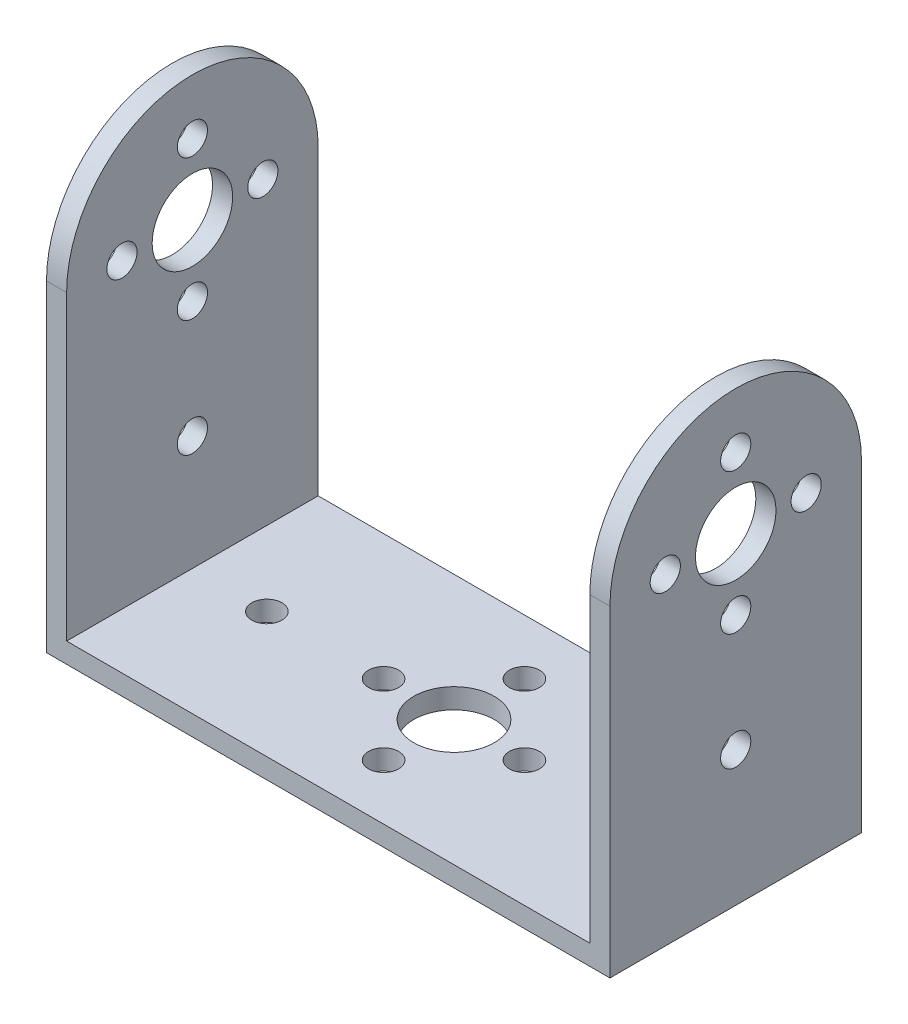
ISO-10303-21;
HEADER;
FILE_DESCRIPTION(('STEP AP214'),'2;1');
FILE_NAME('part.step','',(''),(''),'','','');
FILE_SCHEMA(('AUTOMOTIVE_DESIGN { 1 0 10303 214 1 1 1 1 }'));
ENDSEC;
DATA;
#1=APPLICATION_CONTEXT('core data for automotive mechanical design processes');
#2=APPLICATION_PROTOCOL_DEFINITION('international standard','automotive_design',2000,#1);
#3=PRODUCT_CONTEXT('',#1,'mechanical');
#4=PRODUCT('Part','Part','',(#3));
#5=PRODUCT_RELATED_PRODUCT_CATEGORY('part','',(#4));
#6=PRODUCT_DEFINITION_FORMATION('','',#4);
#7=PRODUCT_DEFINITION_CONTEXT('part definition',#1,'design');
#8=PRODUCT_DEFINITION('design','',#6,#7);
#9=PRODUCT_DEFINITION_SHAPE('','',#8);
#10=(LENGTH_UNIT() NAMED_UNIT(*) SI_UNIT(.MILLI.,.METRE.));
#11=(NAMED_UNIT(*) PLANE_ANGLE_UNIT() SI_UNIT($,.RADIAN.));
#12=(NAMED_UNIT(*) SI_UNIT($,.STERADIAN.) SOLID_ANGLE_UNIT());
#13=UNCERTAINTY_MEASURE_WITH_UNIT(LENGTH_MEASURE(1.E-05),#10,'distance_accuracy_value','');
#14=(GEOMETRIC_REPRESENTATION_CONTEXT(3) GLOBAL_UNCERTAINTY_ASSIGNED_CONTEXT((#13)) GLOBAL_UNIT_ASSIGNED_CONTEXT((#10,
#11,#12)) REPRESENTATION_CONTEXT('',''));
#15=CARTESIAN_POINT('',(0.,0.,0.));
#16=DIRECTION('',(0.,0.,1.));
#17=DIRECTION('',(1.,0.,0.));
#18=AXIS2_PLACEMENT_3D('',#15,#16,#17);
#19=CARTESIAN_POINT('',(25.9999999999998,2.,12.5));
#20=DIRECTION('',(0.,0.,-1.));
#21=DIRECTION('',(-1.,0.,0.));
#22=AXIS2_PLACEMENT_3D('',#19,#20,#21);
#23=PLANE('',#22);
#24=DIRECTION('',(1.,0.,0.));
#25=VECTOR('',#24,1.);
#26=CARTESIAN_POINT('',(25.9999999999998,0.,12.5));
#27=LINE('',#26,#25);
#28=CARTESIAN_POINT('',(-28.0000000000002,0.,12.4999999999999));
#29=VERTEX_POINT('',#28);
#30=CARTESIAN_POINT('',(27.9999999999998,0.,12.5));
#31=VERTEX_POINT('',#30);
#32=EDGE_CURVE('E114',#29,#31,#27,.T.);
#33=ORIENTED_EDGE('',*,*,#32,.T.);
#34=DIRECTION('',(0.,-1.,0.));
#35=VECTOR('',#34,1.);
#36=CARTESIAN_POINT('',(27.9999999999998,0.,12.5));
#37=LINE('',#36,#35);
#38=CARTESIAN_POINT('',(27.9999999999998,32.,12.5));
#39=VERTEX_POINT('',#38);
#40=EDGE_CURVE('E187',#39,#31,#37,.T.);
#41=ORIENTED_EDGE('',*,*,#40,.F.);
#42=DIRECTION('',(-1.,0.,0.));
#43=VECTOR('',#42,1.);
#44=CARTESIAN_POINT('',(27.9999999999998,32.,12.5));
#45=LINE('',#44,#43);
#46=CARTESIAN_POINT('',(25.9999999999998,32.,12.5));
#47=VERTEX_POINT('',#46);
#48=EDGE_CURVE('E196',#39,#47,#45,.T.);
#49=ORIENTED_EDGE('',*,*,#48,.T.);
#50=DIRECTION('',(0.,-1.,0.));
#51=VECTOR('',#50,1.);
#52=CARTESIAN_POINT('',(25.9999999999998,0.,12.5));
#53=LINE('',#52,#51);
#54=CARTESIAN_POINT('',(25.9999999999998,2.,12.5));
#55=VERTEX_POINT('',#54);
#56=EDGE_CURVE('E184',#47,#55,#53,.T.);
#57=ORIENTED_EDGE('',*,*,#56,.T.);
#58=DIRECTION('',(1.,0.,0.));
#59=VECTOR('',#58,1.);
#60=CARTESIAN_POINT('',(25.9999999999998,2.,12.5));
#61=LINE('',#60,#59);
#62=CARTESIAN_POINT('',(-26.0000000000002,2.,12.5));
#63=VERTEX_POINT('',#62);
#64=EDGE_CURVE('E254',#63,#55,#61,.T.);
#65=ORIENTED_EDGE('',*,*,#64,.F.);
#66=DIRECTION('',(0.,1.,0.));
#67=VECTOR('',#66,1.);
#68=CARTESIAN_POINT('',(-26.0000000000002,0.,12.4999999999999));
#69=LINE('',#68,#67);
#70=CARTESIAN_POINT('',(-26.0000000000002,32.,12.4999999999999));
#71=VERTEX_POINT('',#70);
#72=EDGE_CURVE('E61',#63,#71,#69,.T.);
#73=ORIENTED_EDGE('',*,*,#72,.T.);
#74=DIRECTION('',(1.,0.,0.));
#75=VECTOR('',#74,1.);
#76=CARTESIAN_POINT('',(-28.0000000000002,32.,12.4999999999999));
#77=LINE('',#76,#75);
#78=CARTESIAN_POINT('',(-28.0000000000002,32.,12.4999999999999));
#79=VERTEX_POINT('',#78);
#80=EDGE_CURVE('E147',#79,#71,#77,.T.);
#81=ORIENTED_EDGE('',*,*,#80,.F.);
#82=DIRECTION('',(0.,1.,0.));
#83=VECTOR('',#82,1.);
#84=CARTESIAN_POINT('',(-28.0000000000002,0.,12.4999999999999));
#85=LINE('',#84,#83);
#86=EDGE_CURVE('E121',#29,#79,#85,.T.);
#87=ORIENTED_EDGE('',*,*,#86,.F.);
#88=EDGE_LOOP('',(#33,#41,#49,#57,#65,#73,#81,#87));
#89=FACE_BOUND('',#88,.T.);
#90=ADVANCED_FACE('F36',(#89),#23,.F.);
#91=CARTESIAN_POINT('',(25.9999999999998,2.,-12.5000000000001));
#92=DIRECTION('',(0.,0.,1.));
#93=DIRECTION('',(1.,0.,0.));
#94=AXIS2_PLACEMENT_3D('',#91,#92,#93);
#95=PLANE('',#94);
#96=DIRECTION('',(-1.,0.,0.));
#97=VECTOR('',#96,1.);
#98=CARTESIAN_POINT('',(25.9999999999998,0.,-12.5000000000001));
#99=LINE('',#98,#97);
#100=CARTESIAN_POINT('',(27.9999999999998,0.,-12.5));
#101=VERTEX_POINT('',#100);
#102=CARTESIAN_POINT('',(-28.0000000000002,0.,-12.5000000000001));
#103=VERTEX_POINT('',#102);
#104=EDGE_CURVE('E103',#101,#103,#99,.T.);
#105=ORIENTED_EDGE('',*,*,#104,.T.);
#106=DIRECTION('',(0.,-1.,0.));
#107=VECTOR('',#106,1.);
#108=CARTESIAN_POINT('',(-28.0000000000002,0.,-12.5000000000001));
#109=LINE('',#108,#107);
#110=CARTESIAN_POINT('',(-28.0000000000002,32.,-12.5000000000001));
#111=VERTEX_POINT('',#110);
#112=EDGE_CURVE('E108',#111,#103,#109,.T.);
#113=ORIENTED_EDGE('',*,*,#112,.F.);
#114=DIRECTION('',(1.,0.,0.));
#115=VECTOR('',#114,1.);
#116=CARTESIAN_POINT('',(-28.0000000000002,32.,-12.5000000000001));
#117=LINE('',#116,#115);
#118=CARTESIAN_POINT('',(-26.0000000000002,32.,-12.5000000000001));
#119=VERTEX_POINT('',#118);
#120=EDGE_CURVE('E137',#111,#119,#117,.T.);
#121=ORIENTED_EDGE('',*,*,#120,.T.);
#122=DIRECTION('',(0.,-1.,0.));
#123=VECTOR('',#122,1.);
#124=CARTESIAN_POINT('',(-26.0000000000002,0.,-12.5000000000001));
#125=LINE('',#124,#123);
#126=CARTESIAN_POINT('',(-26.0000000000002,2.,-12.5000000000001));
#127=VERTEX_POINT('',#126);
#128=EDGE_CURVE('E142',#119,#127,#125,.T.);
#129=ORIENTED_EDGE('',*,*,#128,.T.);
#130=DIRECTION('',(-1.,0.,0.));
#131=VECTOR('',#130,1.);
#132=CARTESIAN_POINT('',(25.9999999999998,2.,-12.5000000000001));
#133=LINE('',#132,#131);
#134=CARTESIAN_POINT('',(25.9999999999998,2.,-12.5000000000001));
#135=VERTEX_POINT('',#134);
#136=EDGE_CURVE('E11',#135,#127,#133,.T.);
#137=ORIENTED_EDGE('',*,*,#136,.F.);
#138=DIRECTION('',(0.,1.,0.));
#139=VECTOR('',#138,1.);
#140=CARTESIAN_POINT('',(25.9999999999998,0.,-12.5));
#141=LINE('',#140,#139);
#142=CARTESIAN_POINT('',(25.9999999999998,32.,-12.5));
#143=VERTEX_POINT('',#142);
#144=EDGE_CURVE('E53',#135,#143,#141,.T.);
#145=ORIENTED_EDGE('',*,*,#144,.T.);
#146=DIRECTION('',(-1.,0.,0.));
#147=VECTOR('',#146,1.);
#148=CARTESIAN_POINT('',(27.9999999999998,32.,-12.5));
#149=LINE('',#148,#147);
#150=CARTESIAN_POINT('',(27.9999999999998,32.,-12.5));
#151=VERTEX_POINT('',#150);
#152=EDGE_CURVE('E205',#151,#143,#149,.T.);
#153=ORIENTED_EDGE('',*,*,#152,.F.);
#154=DIRECTION('',(0.,1.,0.));
#155=VECTOR('',#154,1.);
#156=CARTESIAN_POINT('',(27.9999999999998,0.,-12.5));
#157=LINE('',#156,#155);
#158=EDGE_CURVE('E110',#101,#151,#157,.T.);
#159=ORIENTED_EDGE('',*,*,#158,.F.);
#160=EDGE_LOOP('',(#105,#113,#121,#129,#137,#145,#153,#159));
#161=FACE_BOUND('',#160,.T.);
#162=ADVANCED_FACE('F105',(#161),#95,.F.);
#163=CARTESIAN_POINT('',(0.,2.,0.));
#164=DIRECTION('',(0.,1.,0.));
#165=DIRECTION('',(0.,0.,1.));
#166=AXIS2_PLACEMENT_3D('',#163,#164,#165);
#167=PLANE('',#166);
#168=CARTESIAN_POINT('',(-18.6,2.,0.));
#169=DIRECTION('',(0.,1.,0.));
#170=DIRECTION('',(0.,0.,1.));
#171=AXIS2_PLACEMENT_3D('',#168,#169,#170);
#172=CIRCLE('',#171,1.5);
#173=CARTESIAN_POINT('',(-18.6,2.,1.5));
#174=VERTEX_POINT('',#173);
#175=EDGE_CURVE('E212',#174,#174,#172,.T.);
#176=ORIENTED_EDGE('',*,*,#175,.F.);
#177=EDGE_LOOP('',(#176));
#178=FACE_BOUND('',#177,.T.);
#179=CARTESIAN_POINT('',(18.6,2.,0.));
#180=DIRECTION('',(0.,1.,0.));
#181=DIRECTION('',(0.,0.,1.));
#182=AXIS2_PLACEMENT_3D('',#179,#180,#181);
#183=CIRCLE('',#182,1.5);
#184=CARTESIAN_POINT('',(18.6,2.,1.5));
#185=VERTEX_POINT('',#184);
#186=EDGE_CURVE('E211',#185,#185,#183,.T.);
#187=ORIENTED_EDGE('',*,*,#186,.F.);
#188=EDGE_LOOP('',(#187));
#189=FACE_BOUND('',#188,.T.);
#190=CARTESIAN_POINT('',(0.,2.,7.));
#191=DIRECTION('',(0.,1.,0.));
#192=DIRECTION('',(0.,0.,1.));
#193=AXIS2_PLACEMENT_3D('',#190,#191,#192);
#194=CIRCLE('',#193,1.5);
#195=CARTESIAN_POINT('',(0.,2.,8.5));
#196=VERTEX_POINT('',#195);
#197=EDGE_CURVE('E218',#196,#196,#194,.T.);
#198=ORIENTED_EDGE('',*,*,#197,.F.);
#199=EDGE_LOOP('',(#198));
#200=FACE_BOUND('',#199,.T.);
#201=CARTESIAN_POINT('',(-7.,2.,0.));
#202=DIRECTION('',(0.,1.,0.));
#203=DIRECTION('',(0.,0.,1.));
#204=AXIS2_PLACEMENT_3D('',#201,#202,#203);
#205=CIRCLE('',#204,1.5);
#206=CARTESIAN_POINT('',(-7.,2.,1.5));
#207=VERTEX_POINT('',#206);
#208=EDGE_CURVE('E224',#207,#207,#205,.T.);
#209=ORIENTED_EDGE('',*,*,#208,.F.);
#210=EDGE_LOOP('',(#209));
#211=FACE_BOUND('',#210,.T.);
#212=CARTESIAN_POINT('',(0.,2.,-7.));
#213=DIRECTION('',(0.,1.,0.));
#214=DIRECTION('',(0.,0.,1.));
#215=AXIS2_PLACEMENT_3D('',#212,#213,#214);
#216=CIRCLE('',#215,1.5);
#217=CARTESIAN_POINT('',(0.,2.,-5.5));
#218=VERTEX_POINT('',#217);
#219=EDGE_CURVE('E230',#218,#218,#216,.T.);
#220=ORIENTED_EDGE('',*,*,#219,.F.);
#221=EDGE_LOOP('',(#220));
#222=FACE_BOUND('',#221,.T.);
#223=CARTESIAN_POINT('',(7.,2.,0.));
#224=DIRECTION('',(0.,1.,0.));
#225=DIRECTION('',(0.,0.,1.));
#226=AXIS2_PLACEMENT_3D('',#223,#224,#225);
#227=CIRCLE('',#226,1.5);
#228=CARTESIAN_POINT('',(7.,2.,1.5));
#229=VERTEX_POINT('',#228);
#230=EDGE_CURVE('E236',#229,#229,#227,.T.);
#231=ORIENTED_EDGE('',*,*,#230,.F.);
#232=EDGE_LOOP('',(#231));
#233=FACE_BOUND('',#232,.T.);
#234=CARTESIAN_POINT('',(0.,2.,0.));
#235=DIRECTION('',(0.,1.,0.));
#236=DIRECTION('',(0.,0.,1.));
#237=AXIS2_PLACEMENT_3D('',#234,#235,#236);
#238=CIRCLE('',#237,4.);
#239=CARTESIAN_POINT('',(0.,2.,4.));
#240=VERTEX_POINT('',#239);
#241=EDGE_CURVE('E242',#240,#240,#238,.T.);
#242=ORIENTED_EDGE('',*,*,#241,.F.);
#243=EDGE_LOOP('',(#242));
#244=FACE_BOUND('',#243,.T.);
#245=DIRECTION('',(0.,0.,1.));
#246=VECTOR('',#245,1.);
#247=CARTESIAN_POINT('',(-26.0000000000002,2.,12.5));
#248=LINE('',#247,#246);
#249=EDGE_CURVE('E39',#127,#63,#248,.T.);
#250=ORIENTED_EDGE('',*,*,#249,.T.);
#251=ORIENTED_EDGE('',*,*,#64,.T.);
#252=DIRECTION('',(0.,0.,-1.));
#253=VECTOR('',#252,1.);
#254=CARTESIAN_POINT('',(25.9999999999998,2.,12.5));
#255=LINE('',#254,#253);
#256=EDGE_CURVE('E45',#55,#135,#255,.T.);
#257=ORIENTED_EDGE('',*,*,#256,.T.);
#258=ORIENTED_EDGE('',*,*,#136,.T.);
#259=EDGE_LOOP('',(#250,#251,#257,#258));
#260=FACE_BOUND('',#259,.T.);
#261=ADVANCED_FACE('F262',(#178,#189,#200,#211,#222,#233,#244,#260),#167,.T.);
#262=CARTESIAN_POINT('',(0.,0.,0.));
#263=DIRECTION('',(0.,1.,0.));
#264=DIRECTION('',(0.,0.,1.));
#265=AXIS2_PLACEMENT_3D('',#262,#263,#264);
#266=PLANE('',#265);
#267=CARTESIAN_POINT('',(-18.6,0.,0.));
#268=DIRECTION('',(0.,1.,0.));
#269=DIRECTION('',(0.,0.,1.));
#270=AXIS2_PLACEMENT_3D('',#267,#268,#269);
#271=CIRCLE('',#270,1.5);
#272=CARTESIAN_POINT('',(-18.6,0.,1.5));
#273=VERTEX_POINT('',#272);
#274=EDGE_CURVE('E208',#273,#273,#271,.T.);
#275=ORIENTED_EDGE('',*,*,#274,.T.);
#276=EDGE_LOOP('',(#275));
#277=FACE_BOUND('',#276,.T.);
#278=CARTESIAN_POINT('',(18.6,0.,0.));
#279=DIRECTION('',(0.,1.,0.));
#280=DIRECTION('',(0.,0.,1.));
#281=AXIS2_PLACEMENT_3D('',#278,#279,#280);
#282=CIRCLE('',#281,1.5);
#283=CARTESIAN_POINT('',(18.6,0.,1.5));
#284=VERTEX_POINT('',#283);
#285=EDGE_CURVE('E215',#284,#284,#282,.T.);
#286=ORIENTED_EDGE('',*,*,#285,.T.);
#287=EDGE_LOOP('',(#286));
#288=FACE_BOUND('',#287,.T.);
#289=CARTESIAN_POINT('',(0.,0.,7.));
#290=DIRECTION('',(0.,1.,0.));
#291=DIRECTION('',(0.,0.,1.));
#292=AXIS2_PLACEMENT_3D('',#289,#290,#291);
#293=CIRCLE('',#292,1.5);
#294=CARTESIAN_POINT('',(0.,0.,8.5));
#295=VERTEX_POINT('',#294);
#296=EDGE_CURVE('E221',#295,#295,#293,.T.);
#297=ORIENTED_EDGE('',*,*,#296,.T.);
#298=EDGE_LOOP('',(#297));
#299=FACE_BOUND('',#298,.T.);
#300=CARTESIAN_POINT('',(-7.,0.,0.));
#301=DIRECTION('',(0.,1.,0.));
#302=DIRECTION('',(0.,0.,1.));
#303=AXIS2_PLACEMENT_3D('',#300,#301,#302);
#304=CIRCLE('',#303,1.5);
#305=CARTESIAN_POINT('',(-7.,0.,1.5));
#306=VERTEX_POINT('',#305);
#307=EDGE_CURVE('E227',#306,#306,#304,.T.);
#308=ORIENTED_EDGE('',*,*,#307,.T.);
#309=EDGE_LOOP('',(#308));
#310=FACE_BOUND('',#309,.T.);
#311=CARTESIAN_POINT('',(0.,0.,-7.));
#312=DIRECTION('',(0.,1.,0.));
#313=DIRECTION('',(0.,0.,1.));
#314=AXIS2_PLACEMENT_3D('',#311,#312,#313);
#315=CIRCLE('',#314,1.5);
#316=CARTESIAN_POINT('',(0.,0.,-5.5));
#317=VERTEX_POINT('',#316);
#318=EDGE_CURVE('E233',#317,#317,#315,.T.);
#319=ORIENTED_EDGE('',*,*,#318,.T.);
#320=EDGE_LOOP('',(#319));
#321=FACE_BOUND('',#320,.T.);
#322=CARTESIAN_POINT('',(7.,0.,0.));
#323=DIRECTION('',(0.,1.,0.));
#324=DIRECTION('',(0.,0.,1.));
#325=AXIS2_PLACEMENT_3D('',#322,#323,#324);
#326=CIRCLE('',#325,1.5);
#327=CARTESIAN_POINT('',(7.,0.,1.5));
#328=VERTEX_POINT('',#327);
#329=EDGE_CURVE('E239',#328,#328,#326,.T.);
#330=ORIENTED_EDGE('',*,*,#329,.T.);
#331=EDGE_LOOP('',(#330));
#332=FACE_BOUND('',#331,.T.);
#333=CARTESIAN_POINT('',(0.,0.,0.));
#334=DIRECTION('',(0.,1.,0.));
#335=DIRECTION('',(0.,0.,1.));
#336=AXIS2_PLACEMENT_3D('',#333,#334,#335);
#337=CIRCLE('',#336,4.);
#338=CARTESIAN_POINT('',(0.,0.,4.));
#339=VERTEX_POINT('',#338);
#340=EDGE_CURVE('E245',#339,#339,#337,.T.);
#341=ORIENTED_EDGE('',*,*,#340,.T.);
#342=EDGE_LOOP('',(#341));
#343=FACE_BOUND('',#342,.T.);
#344=ORIENTED_EDGE('',*,*,#32,.F.);
#345=DIRECTION('',(0.,0.,1.));
#346=VECTOR('',#345,1.);
#347=CARTESIAN_POINT('',(-28.0000000000002,0.,-12.5000000000001));
#348=LINE('',#347,#346);
#349=EDGE_CURVE('E117',#103,#29,#348,.T.);
#350=ORIENTED_EDGE('',*,*,#349,.F.);
#351=ORIENTED_EDGE('',*,*,#104,.F.);
#352=DIRECTION('',(0.,0.,-1.));
#353=VECTOR('',#352,1.);
#354=CARTESIAN_POINT('',(27.9999999999998,0.,12.5));
#355=LINE('',#354,#353);
#356=EDGE_CURVE('E190',#31,#101,#355,.T.);
#357=ORIENTED_EDGE('',*,*,#356,.F.);
#358=EDGE_LOOP('',(#344,#350,#351,#357));
#359=FACE_BOUND('',#358,.T.);
#360=ADVANCED_FACE('F118',(#277,#288,#299,#310,#321,#332,#343,#359),#266,.F.);
#361=CARTESIAN_POINT('',(0.,0.,0.));
#362=DIRECTION('',(0.,1.,0.));
#363=DIRECTION('',(0.,0.,1.));
#364=AXIS2_PLACEMENT_3D('',#361,#362,#363);
#365=CYLINDRICAL_SURFACE('',#364,4.);
#366=ORIENTED_EDGE('',*,*,#340,.F.);
#367=EDGE_LOOP('',(#366));
#368=FACE_BOUND('',#367,.T.);
#369=ORIENTED_EDGE('',*,*,#241,.T.);
#370=EDGE_LOOP('',(#369));
#371=FACE_BOUND('',#370,.T.);
#372=ADVANCED_FACE('F334',(#368,#371),#365,.F.);
#373=CARTESIAN_POINT('',(7.,0.,0.));
#374=DIRECTION('',(0.,1.,0.));
#375=DIRECTION('',(0.,0.,1.));
#376=AXIS2_PLACEMENT_3D('',#373,#374,#375);
#377=CYLINDRICAL_SURFACE('',#376,1.5);
#378=ORIENTED_EDGE('',*,*,#329,.F.);
#379=EDGE_LOOP('',(#378));
#380=FACE_BOUND('',#379,.T.);
#381=ORIENTED_EDGE('',*,*,#230,.T.);
#382=EDGE_LOOP('',(#381));
#383=FACE_BOUND('',#382,.T.);
#384=ADVANCED_FACE('F339',(#380,#383),#377,.F.);
#385=CARTESIAN_POINT('',(0.,0.,-7.));
#386=DIRECTION('',(0.,1.,0.));
#387=DIRECTION('',(0.,0.,1.));
#388=AXIS2_PLACEMENT_3D('',#385,#386,#387);
#389=CYLINDRICAL_SURFACE('',#388,1.5);
#390=ORIENTED_EDGE('',*,*,#318,.F.);
#391=EDGE_LOOP('',(#390));
#392=FACE_BOUND('',#391,.T.);
#393=ORIENTED_EDGE('',*,*,#219,.T.);
#394=EDGE_LOOP('',(#393));
#395=FACE_BOUND('',#394,.T.);
#396=ADVANCED_FACE('F343',(#392,#395),#389,.F.);
#397=CARTESIAN_POINT('',(-7.,0.,0.));
#398=DIRECTION('',(0.,1.,0.));
#399=DIRECTION('',(0.,0.,1.));
#400=AXIS2_PLACEMENT_3D('',#397,#398,#399);
#401=CYLINDRICAL_SURFACE('',#400,1.5);
#402=ORIENTED_EDGE('',*,*,#307,.F.);
#403=EDGE_LOOP('',(#402));
#404=FACE_BOUND('',#403,.T.);
#405=ORIENTED_EDGE('',*,*,#208,.T.);
#406=EDGE_LOOP('',(#405));
#407=FACE_BOUND('',#406,.T.);
#408=ADVANCED_FACE('F347',(#404,#407),#401,.F.);
#409=CARTESIAN_POINT('',(0.,0.,7.));
#410=DIRECTION('',(0.,1.,0.));
#411=DIRECTION('',(0.,0.,1.));
#412=AXIS2_PLACEMENT_3D('',#409,#410,#411);
#413=CYLINDRICAL_SURFACE('',#412,1.5);
#414=ORIENTED_EDGE('',*,*,#296,.F.);
#415=EDGE_LOOP('',(#414));
#416=FACE_BOUND('',#415,.T.);
#417=ORIENTED_EDGE('',*,*,#197,.T.);
#418=EDGE_LOOP('',(#417));
#419=FACE_BOUND('',#418,.T.);
#420=ADVANCED_FACE('F351',(#416,#419),#413,.F.);
#421=CARTESIAN_POINT('',(18.6,0.,0.));
#422=DIRECTION('',(0.,1.,0.));
#423=DIRECTION('',(0.,0.,1.));
#424=AXIS2_PLACEMENT_3D('',#421,#422,#423);
#425=CYLINDRICAL_SURFACE('',#424,1.5);
#426=ORIENTED_EDGE('',*,*,#285,.F.);
#427=EDGE_LOOP('',(#426));
#428=FACE_BOUND('',#427,.T.);
#429=ORIENTED_EDGE('',*,*,#186,.T.);
#430=EDGE_LOOP('',(#429));
#431=FACE_BOUND('',#430,.T.);
#432=ADVANCED_FACE('F355',(#428,#431),#425,.F.);
#433=CARTESIAN_POINT('',(-18.6,0.,0.));
#434=DIRECTION('',(0.,1.,0.));
#435=DIRECTION('',(0.,0.,1.));
#436=AXIS2_PLACEMENT_3D('',#433,#434,#435);
#437=CYLINDRICAL_SURFACE('',#436,1.5);
#438=ORIENTED_EDGE('',*,*,#274,.F.);
#439=EDGE_LOOP('',(#438));
#440=FACE_BOUND('',#439,.T.);
#441=ORIENTED_EDGE('',*,*,#175,.T.);
#442=EDGE_LOOP('',(#441));
#443=FACE_BOUND('',#442,.T.);
#444=ADVANCED_FACE('F301',(#440,#443),#437,.F.);
#445=CARTESIAN_POINT('',(25.9999999999998,32.,0.));
#446=DIRECTION('',(-1.,0.,0.));
#447=DIRECTION('',(0.,0.,1.));
#448=AXIS2_PLACEMENT_3D('',#445,#446,#447);
#449=PLANE('',#448);
#450=CARTESIAN_POINT('',(25.9999999999998,13.4,0.));
#451=DIRECTION('',(1.,0.,0.));
#452=DIRECTION('',(0.,0.,-1.));
#453=AXIS2_PLACEMENT_3D('',#450,#451,#452);
#454=CIRCLE('',#453,1.5);
#455=CARTESIAN_POINT('',(25.9999999999998,13.4,-1.50000000000005));
#456=VERTEX_POINT('',#455);
#457=EDGE_CURVE('E154',#456,#456,#454,.T.);
#458=ORIENTED_EDGE('',*,*,#457,.T.);
#459=EDGE_LOOP('',(#458));
#460=FACE_BOUND('',#459,.T.);
#461=CARTESIAN_POINT('',(25.9999999999998,25.,0.));
#462=DIRECTION('',(1.,0.,0.));
#463=DIRECTION('',(0.,0.,-1.));
#464=AXIS2_PLACEMENT_3D('',#461,#462,#463);
#465=CIRCLE('',#464,1.5);
#466=CARTESIAN_POINT('',(25.9999999999998,25.,-1.50000000000005));
#467=VERTEX_POINT('',#466);
#468=EDGE_CURVE('E160',#467,#467,#465,.T.);
#469=ORIENTED_EDGE('',*,*,#468,.T.);
#470=EDGE_LOOP('',(#469));
#471=FACE_BOUND('',#470,.T.);
#472=CARTESIAN_POINT('',(25.9999999999998,39.,0.));
#473=DIRECTION('',(1.,0.,0.));
#474=DIRECTION('',(0.,0.,-1.));
#475=AXIS2_PLACEMENT_3D('',#472,#473,#474);
#476=CIRCLE('',#475,1.5);
#477=CARTESIAN_POINT('',(25.9999999999998,39.,-1.50000000000005));
#478=VERTEX_POINT('',#477);
#479=EDGE_CURVE('E172',#478,#478,#476,.T.);
#480=ORIENTED_EDGE('',*,*,#479,.T.);
#481=EDGE_LOOP('',(#480));
#482=FACE_BOUND('',#481,.T.);
#483=CARTESIAN_POINT('',(25.9999999999998,32.,0.));
#484=DIRECTION('',(1.,0.,0.));
#485=DIRECTION('',(0.,0.,-1.));
#486=AXIS2_PLACEMENT_3D('',#483,#484,#485);
#487=CIRCLE('',#486,4.);
#488=CARTESIAN_POINT('',(25.9999999999998,32.,-4.00000000000005));
#489=VERTEX_POINT('',#488);
#490=EDGE_CURVE('E178',#489,#489,#487,.T.);
#491=ORIENTED_EDGE('',*,*,#490,.T.);
#492=EDGE_LOOP('',(#491));
#493=FACE_BOUND('',#492,.T.);
#494=CARTESIAN_POINT('',(25.9999999999998,32.,-7.00000000000005));
#495=DIRECTION('',(1.,0.,0.));
#496=DIRECTION('',(0.,0.,-1.));
#497=AXIS2_PLACEMENT_3D('',#494,#495,#496);
#498=CIRCLE('',#497,1.5);
#499=CARTESIAN_POINT('',(25.9999999999998,32.,-8.50000000000005));
#500=VERTEX_POINT('',#499);
#501=EDGE_CURVE('E166',#500,#500,#498,.T.);
#502=ORIENTED_EDGE('',*,*,#501,.T.);
#503=EDGE_LOOP('',(#502));
#504=FACE_BOUND('',#503,.T.);
#505=CARTESIAN_POINT('',(25.9999999999998,32.,6.99999999999995));
#506=DIRECTION('',(1.,0.,0.));
#507=DIRECTION('',(0.,0.,-1.));
#508=AXIS2_PLACEMENT_3D('',#505,#506,#507);
#509=CIRCLE('',#508,1.5);
#510=CARTESIAN_POINT('',(25.9999999999998,32.,5.49999999999995));
#511=VERTEX_POINT('',#510);
#512=EDGE_CURVE('E153',#511,#511,#509,.T.);
#513=ORIENTED_EDGE('',*,*,#512,.T.);
#514=EDGE_LOOP('',(#513));
#515=FACE_BOUND('',#514,.T.);
#516=ORIENTED_EDGE('',*,*,#256,.F.);
#517=ORIENTED_EDGE('',*,*,#56,.F.);
#518=CARTESIAN_POINT('',(25.9999999999998,32.,0.));
#519=DIRECTION('',(1.,0.,0.));
#520=DIRECTION('',(0.,0.,1.));
#521=AXIS2_PLACEMENT_3D('',#518,#519,#520);
#522=CIRCLE('',#521,12.5);
#523=EDGE_CURVE('E191',#143,#47,#522,.T.);
#524=ORIENTED_EDGE('',*,*,#523,.F.);
#525=ORIENTED_EDGE('',*,*,#144,.F.);
#526=EDGE_LOOP('',(#516,#517,#524,#525));
#527=FACE_BOUND('',#526,.T.);
#528=ADVANCED_FACE('F275',(#460,#471,#482,#493,#504,#515,#527),#449,.T.);
#529=CARTESIAN_POINT('',(27.9999999999998,32.,0.));
#530=DIRECTION('',(-1.,0.,0.));
#531=DIRECTION('',(0.,0.,1.));
#532=AXIS2_PLACEMENT_3D('',#529,#530,#531);
#533=PLANE('',#532);
#534=CARTESIAN_POINT('',(27.9999999999998,32.,6.99999999999995));
#535=DIRECTION('',(1.,0.,0.));
#536=DIRECTION('',(0.,0.,-1.));
#537=AXIS2_PLACEMENT_3D('',#534,#535,#536);
#538=CIRCLE('',#537,1.5);
#539=CARTESIAN_POINT('',(27.9999999999998,32.,5.49999999999995));
#540=VERTEX_POINT('',#539);
#541=EDGE_CURVE('E157',#540,#540,#538,.T.);
#542=ORIENTED_EDGE('',*,*,#541,.F.);
#543=EDGE_LOOP('',(#542));
#544=FACE_BOUND('',#543,.T.);
#545=CARTESIAN_POINT('',(27.9999999999998,32.,-7.00000000000005));
#546=DIRECTION('',(1.,0.,0.));
#547=DIRECTION('',(0.,0.,-1.));
#548=AXIS2_PLACEMENT_3D('',#545,#546,#547);
#549=CIRCLE('',#548,1.5);
#550=CARTESIAN_POINT('',(27.9999999999998,32.,-8.50000000000005));
#551=VERTEX_POINT('',#550);
#552=EDGE_CURVE('E169',#551,#551,#549,.T.);
#553=ORIENTED_EDGE('',*,*,#552,.F.);
#554=EDGE_LOOP('',(#553));
#555=FACE_BOUND('',#554,.T.);
#556=CARTESIAN_POINT('',(27.9999999999998,32.,0.));
#557=DIRECTION('',(1.,0.,0.));
#558=DIRECTION('',(0.,0.,-1.));
#559=AXIS2_PLACEMENT_3D('',#556,#557,#558);
#560=CIRCLE('',#559,4.);
#561=CARTESIAN_POINT('',(27.9999999999998,32.,-4.00000000000005));
#562=VERTEX_POINT('',#561);
#563=EDGE_CURVE('E181',#562,#562,#560,.T.);
#564=ORIENTED_EDGE('',*,*,#563,.F.);
#565=EDGE_LOOP('',(#564));
#566=FACE_BOUND('',#565,.T.);
#567=ORIENTED_EDGE('',*,*,#40,.T.);
#568=ORIENTED_EDGE('',*,*,#356,.T.);
#569=ORIENTED_EDGE('',*,*,#158,.T.);
#570=CARTESIAN_POINT('',(27.9999999999998,32.,0.));
#571=DIRECTION('',(1.,0.,0.));
#572=DIRECTION('',(0.,0.,1.));
#573=AXIS2_PLACEMENT_3D('',#570,#571,#572);
#574=CIRCLE('',#573,12.5);
#575=EDGE_CURVE('E194',#151,#39,#574,.T.);
#576=ORIENTED_EDGE('',*,*,#575,.T.);
#577=EDGE_LOOP('',(#567,#568,#569,#576));
#578=FACE_BOUND('',#577,.T.);
#579=CARTESIAN_POINT('',(27.9999999999998,39.,0.));
#580=DIRECTION('',(1.,0.,0.));
#581=DIRECTION('',(0.,0.,-1.));
#582=AXIS2_PLACEMENT_3D('',#579,#580,#581);
#583=CIRCLE('',#582,1.5);
#584=CARTESIAN_POINT('',(27.9999999999998,39.,-1.50000000000005));
#585=VERTEX_POINT('',#584);
#586=EDGE_CURVE('E175',#585,#585,#583,.T.);
#587=ORIENTED_EDGE('',*,*,#586,.F.);
#588=EDGE_LOOP('',(#587));
#589=FACE_BOUND('',#588,.T.);
#590=CARTESIAN_POINT('',(27.9999999999998,25.,0.));
#591=DIRECTION('',(1.,0.,0.));
#592=DIRECTION('',(0.,0.,-1.));
#593=AXIS2_PLACEMENT_3D('',#590,#591,#592);
#594=CIRCLE('',#593,1.5);
#595=CARTESIAN_POINT('',(27.9999999999998,25.,-1.50000000000005));
#596=VERTEX_POINT('',#595);
#597=EDGE_CURVE('E163',#596,#596,#594,.T.);
#598=ORIENTED_EDGE('',*,*,#597,.F.);
#599=EDGE_LOOP('',(#598));
#600=FACE_BOUND('',#599,.T.);
#601=CARTESIAN_POINT('',(27.9999999999998,13.4,0.));
#602=DIRECTION('',(1.,0.,0.));
#603=DIRECTION('',(0.,0.,-1.));
#604=AXIS2_PLACEMENT_3D('',#601,#602,#603);
#605=CIRCLE('',#604,1.5);
#606=CARTESIAN_POINT('',(27.9999999999998,13.4,-1.50000000000005));
#607=VERTEX_POINT('',#606);
#608=EDGE_CURVE('E150',#607,#607,#605,.T.);
#609=ORIENTED_EDGE('',*,*,#608,.F.);
#610=EDGE_LOOP('',(#609));
#611=FACE_BOUND('',#610,.T.);
#612=ADVANCED_FACE('F281',(#544,#555,#566,#578,#589,#600,#611),#533,.F.);
#613=CARTESIAN_POINT('',(27.9999999999998,32.,0.));
#614=DIRECTION('',(-1.,0.,0.));
#615=DIRECTION('',(0.,0.,1.));
#616=AXIS2_PLACEMENT_3D('',#613,#614,#615);
#617=CYLINDRICAL_SURFACE('',#616,12.5);
#618=ORIENTED_EDGE('',*,*,#523,.T.);
#619=ORIENTED_EDGE('',*,*,#48,.F.);
#620=ORIENTED_EDGE('',*,*,#575,.F.);
#621=ORIENTED_EDGE('',*,*,#152,.T.);
#622=EDGE_LOOP('',(#618,#619,#620,#621));
#623=FACE_BOUND('',#622,.T.);
#624=ADVANCED_FACE('F279',(#623),#617,.T.);
#625=CARTESIAN_POINT('',(27.9999999999998,32.,0.));
#626=DIRECTION('',(-1.,0.,0.));
#627=DIRECTION('',(0.,0.,1.));
#628=AXIS2_PLACEMENT_3D('',#625,#626,#627);
#629=CYLINDRICAL_SURFACE('',#628,4.);
#630=ORIENTED_EDGE('',*,*,#563,.T.);
#631=EDGE_LOOP('',(#630));
#632=FACE_BOUND('',#631,.T.);
#633=ORIENTED_EDGE('',*,*,#490,.F.);
#634=EDGE_LOOP('',(#633));
#635=FACE_BOUND('',#634,.T.);
#636=ADVANCED_FACE('F364',(#632,#635),#629,.F.);
#637=CARTESIAN_POINT('',(27.9999999999998,39.,0.));
#638=DIRECTION('',(-1.,0.,0.));
#639=DIRECTION('',(0.,0.,1.));
#640=AXIS2_PLACEMENT_3D('',#637,#638,#639);
#641=CYLINDRICAL_SURFACE('',#640,1.5);
#642=ORIENTED_EDGE('',*,*,#586,.T.);
#643=EDGE_LOOP('',(#642));
#644=FACE_BOUND('',#643,.T.);
#645=ORIENTED_EDGE('',*,*,#479,.F.);
#646=EDGE_LOOP('',(#645));
#647=FACE_BOUND('',#646,.T.);
#648=ADVANCED_FACE('F368',(#644,#647),#641,.F.);
#649=CARTESIAN_POINT('',(27.9999999999998,32.,-7.00000000000005));
#650=DIRECTION('',(-1.,0.,0.));
#651=DIRECTION('',(0.,0.,1.));
#652=AXIS2_PLACEMENT_3D('',#649,#650,#651);
#653=CYLINDRICAL_SURFACE('',#652,1.5);
#654=ORIENTED_EDGE('',*,*,#552,.T.);
#655=EDGE_LOOP('',(#654));
#656=FACE_BOUND('',#655,.T.);
#657=ORIENTED_EDGE('',*,*,#501,.F.);
#658=EDGE_LOOP('',(#657));
#659=FACE_BOUND('',#658,.T.);
#660=ADVANCED_FACE('F320',(#656,#659),#653,.F.);
#661=CARTESIAN_POINT('',(27.9999999999998,25.,0.));
#662=DIRECTION('',(-1.,0.,0.));
#663=DIRECTION('',(0.,0.,1.));
#664=AXIS2_PLACEMENT_3D('',#661,#662,#663);
#665=CYLINDRICAL_SURFACE('',#664,1.5);
#666=ORIENTED_EDGE('',*,*,#597,.T.);
#667=EDGE_LOOP('',(#666));
#668=FACE_BOUND('',#667,.T.);
#669=ORIENTED_EDGE('',*,*,#468,.F.);
#670=EDGE_LOOP('',(#669));
#671=FACE_BOUND('',#670,.T.);
#672=ADVANCED_FACE('F314',(#668,#671),#665,.F.);
#673=CARTESIAN_POINT('',(27.9999999999998,32.,6.99999999999995));
#674=DIRECTION('',(-1.,0.,0.));
#675=DIRECTION('',(0.,0.,1.));
#676=AXIS2_PLACEMENT_3D('',#673,#674,#675);
#677=CYLINDRICAL_SURFACE('',#676,1.5);
#678=ORIENTED_EDGE('',*,*,#541,.T.);
#679=EDGE_LOOP('',(#678));
#680=FACE_BOUND('',#679,.T.);
#681=ORIENTED_EDGE('',*,*,#512,.F.);
#682=EDGE_LOOP('',(#681));
#683=FACE_BOUND('',#682,.T.);
#684=ADVANCED_FACE('F295',(#680,#683),#677,.F.);
#685=CARTESIAN_POINT('',(27.9999999999998,13.4,0.));
#686=DIRECTION('',(-1.,0.,0.));
#687=DIRECTION('',(0.,0.,1.));
#688=AXIS2_PLACEMENT_3D('',#685,#686,#687);
#689=CYLINDRICAL_SURFACE('',#688,1.5);
#690=ORIENTED_EDGE('',*,*,#608,.T.);
#691=EDGE_LOOP('',(#690));
#692=FACE_BOUND('',#691,.T.);
#693=ORIENTED_EDGE('',*,*,#457,.F.);
#694=EDGE_LOOP('',(#693));
#695=FACE_BOUND('',#694,.T.);
#696=ADVANCED_FACE('F292',(#692,#695),#689,.F.);
#697=CARTESIAN_POINT('',(-26.0000000000002,32.,0.));
#698=DIRECTION('',(1.,0.,0.));
#699=DIRECTION('',(0.,0.,-1.));
#700=AXIS2_PLACEMENT_3D('',#697,#698,#699);
#701=PLANE('',#700);
#702=CARTESIAN_POINT('',(-26.0000000000002,13.4,0.));
#703=DIRECTION('',(-1.,0.,0.));
#704=DIRECTION('',(0.,0.,1.));
#705=AXIS2_PLACEMENT_3D('',#702,#703,#704);
#706=CIRCLE('',#705,1.5);
#707=CARTESIAN_POINT('',(-26.0000000000002,13.4,1.49999999999996));
#708=VERTEX_POINT('',#707);
#709=EDGE_CURVE('E520',#708,#708,#706,.T.);
#710=ORIENTED_EDGE('',*,*,#709,.T.);
#711=EDGE_LOOP('',(#710));
#712=FACE_BOUND('',#711,.T.);
#713=CARTESIAN_POINT('',(-26.0000000000002,25.,0.));
#714=DIRECTION('',(-1.,0.,0.));
#715=DIRECTION('',(0.,0.,1.));
#716=AXIS2_PLACEMENT_3D('',#713,#714,#715);
#717=CIRCLE('',#716,1.5);
#718=CARTESIAN_POINT('',(-26.0000000000002,25.,1.49999999999995));
#719=VERTEX_POINT('',#718);
#720=EDGE_CURVE('E528',#719,#719,#717,.T.);
#721=ORIENTED_EDGE('',*,*,#720,.T.);
#722=EDGE_LOOP('',(#721));
#723=FACE_BOUND('',#722,.T.);
#724=CARTESIAN_POINT('',(-26.0000000000002,39.,0.));
#725=DIRECTION('',(-1.,0.,0.));
#726=DIRECTION('',(0.,0.,1.));
#727=AXIS2_PLACEMENT_3D('',#724,#725,#726);
#728=CIRCLE('',#727,1.49633998204764);
#729=CARTESIAN_POINT('',(-26.0000000000002,39.,1.4963399820476));
#730=VERTEX_POINT('',#729);
#731=EDGE_CURVE('E540',#730,#730,#728,.T.);
#732=ORIENTED_EDGE('',*,*,#731,.T.);
#733=EDGE_LOOP('',(#732));
#734=FACE_BOUND('',#733,.T.);
#735=CARTESIAN_POINT('',(-26.0000000000002,32.,0.));
#736=DIRECTION('',(-1.,0.,0.));
#737=DIRECTION('',(0.,0.,1.));
#738=AXIS2_PLACEMENT_3D('',#735,#736,#737);
#739=CIRCLE('',#738,3.99999999999999);
#740=CARTESIAN_POINT('',(-26.0000000000002,32.,3.99999999999992));
#741=VERTEX_POINT('',#740);
#742=EDGE_CURVE('E132',#741,#741,#739,.T.);
#743=ORIENTED_EDGE('',*,*,#742,.T.);
#744=EDGE_LOOP('',(#743));
#745=FACE_BOUND('',#744,.T.);
#746=CARTESIAN_POINT('',(-26.0000000000002,32.,6.99999999999995));
#747=DIRECTION('',(-1.,0.,0.));
#748=DIRECTION('',(0.,0.,1.));
#749=AXIS2_PLACEMENT_3D('',#746,#747,#748);
#750=CIRCLE('',#749,1.5);
#751=CARTESIAN_POINT('',(-26.0000000000002,32.,8.49999999999996));
#752=VERTEX_POINT('',#751);
#753=EDGE_CURVE('E534',#752,#752,#750,.T.);
#754=ORIENTED_EDGE('',*,*,#753,.T.);
#755=EDGE_LOOP('',(#754));
#756=FACE_BOUND('',#755,.T.);
#757=CARTESIAN_POINT('',(-26.0000000000002,32.,-7.00000000000005));
#758=DIRECTION('',(-1.,0.,0.));
#759=DIRECTION('',(0.,0.,1.));
#760=AXIS2_PLACEMENT_3D('',#757,#758,#759);
#761=CIRCLE('',#760,1.5);
#762=CARTESIAN_POINT('',(-26.0000000000002,32.,-5.50000000000004));
#763=VERTEX_POINT('',#762);
#764=EDGE_CURVE('E522',#763,#763,#761,.T.);
#765=ORIENTED_EDGE('',*,*,#764,.T.);
#766=EDGE_LOOP('',(#765));
#767=FACE_BOUND('',#766,.T.);
#768=ORIENTED_EDGE('',*,*,#249,.F.);
#769=ORIENTED_EDGE('',*,*,#128,.F.);
#770=CARTESIAN_POINT('',(-26.0000000000002,32.,0.));
#771=DIRECTION('',(-1.,0.,0.));
#772=DIRECTION('',(0.,0.,-1.));
#773=AXIS2_PLACEMENT_3D('',#770,#771,#772);
#774=CIRCLE('',#773,12.5);
#775=EDGE_CURVE('E128',#71,#119,#774,.T.);
#776=ORIENTED_EDGE('',*,*,#775,.F.);
#777=ORIENTED_EDGE('',*,*,#72,.F.);
#778=EDGE_LOOP('',(#768,#769,#776,#777));
#779=FACE_BOUND('',#778,.T.);
#780=ADVANCED_FACE('F265',(#712,#723,#734,#745,#756,#767,#779),#701,.T.);
#781=CARTESIAN_POINT('',(-28.0000000000002,32.,0.));
#782=DIRECTION('',(1.,0.,0.));
#783=DIRECTION('',(0.,0.,-1.));
#784=AXIS2_PLACEMENT_3D('',#781,#782,#783);
#785=PLANE('',#784);
#786=CARTESIAN_POINT('',(-28.0000000000002,32.,-7.00000000000005));
#787=DIRECTION('',(-1.,0.,0.));
#788=DIRECTION('',(0.,0.,1.));
#789=AXIS2_PLACEMENT_3D('',#786,#787,#788);
#790=CIRCLE('',#789,1.5);
#791=CARTESIAN_POINT('',(-28.0000000000002,32.,-5.50000000000004));
#792=VERTEX_POINT('',#791);
#793=EDGE_CURVE('E525',#792,#792,#790,.T.);
#794=ORIENTED_EDGE('',*,*,#793,.F.);
#795=EDGE_LOOP('',(#794));
#796=FACE_BOUND('',#795,.T.);
#797=CARTESIAN_POINT('',(-28.0000000000002,32.,6.99999999999995));
#798=DIRECTION('',(-1.,0.,0.));
#799=DIRECTION('',(0.,0.,1.));
#800=AXIS2_PLACEMENT_3D('',#797,#798,#799);
#801=CIRCLE('',#800,1.5);
#802=CARTESIAN_POINT('',(-28.0000000000002,32.,8.49999999999996));
#803=VERTEX_POINT('',#802);
#804=EDGE_CURVE('E537',#803,#803,#801,.T.);
#805=ORIENTED_EDGE('',*,*,#804,.F.);
#806=EDGE_LOOP('',(#805));
#807=FACE_BOUND('',#806,.T.);
#808=CARTESIAN_POINT('',(-28.0000000000002,32.,0.));
#809=DIRECTION('',(-1.,0.,0.));
#810=DIRECTION('',(0.,0.,1.));
#811=AXIS2_PLACEMENT_3D('',#808,#809,#810);
#812=CIRCLE('',#811,3.99999999999999);
#813=CARTESIAN_POINT('',(-28.0000000000002,32.,3.99999999999992));
#814=VERTEX_POINT('',#813);
#815=EDGE_CURVE('E146',#814,#814,#812,.T.);
#816=ORIENTED_EDGE('',*,*,#815,.F.);
#817=EDGE_LOOP('',(#816));
#818=FACE_BOUND('',#817,.T.);
#819=ORIENTED_EDGE('',*,*,#112,.T.);
#820=ORIENTED_EDGE('',*,*,#349,.T.);
#821=ORIENTED_EDGE('',*,*,#86,.T.);
#822=CARTESIAN_POINT('',(-28.0000000000002,32.,0.));
#823=DIRECTION('',(-1.,0.,0.));
#824=DIRECTION('',(0.,0.,-1.));
#825=AXIS2_PLACEMENT_3D('',#822,#823,#824);
#826=CIRCLE('',#825,12.5);
#827=EDGE_CURVE('E126',#79,#111,#826,.T.);
#828=ORIENTED_EDGE('',*,*,#827,.T.);
#829=EDGE_LOOP('',(#819,#820,#821,#828));
#830=FACE_BOUND('',#829,.T.);
#831=CARTESIAN_POINT('',(-28.0000000000002,39.,0.));
#832=DIRECTION('',(-1.,0.,0.));
#833=DIRECTION('',(0.,0.,1.));
#834=AXIS2_PLACEMENT_3D('',#831,#832,#833);
#835=CIRCLE('',#834,1.49633998204764);
#836=CARTESIAN_POINT('',(-28.0000000000002,39.,1.4963399820476));
#837=VERTEX_POINT('',#836);
#838=EDGE_CURVE('E543',#837,#837,#835,.T.);
#839=ORIENTED_EDGE('',*,*,#838,.F.);
#840=EDGE_LOOP('',(#839));
#841=FACE_BOUND('',#840,.T.);
#842=CARTESIAN_POINT('',(-28.0000000000002,25.,0.));
#843=DIRECTION('',(-1.,0.,0.));
#844=DIRECTION('',(0.,0.,1.));
#845=AXIS2_PLACEMENT_3D('',#842,#843,#844);
#846=CIRCLE('',#845,1.5);
#847=CARTESIAN_POINT('',(-28.0000000000002,25.,1.49999999999995));
#848=VERTEX_POINT('',#847);
#849=EDGE_CURVE('E531',#848,#848,#846,.T.);
#850=ORIENTED_EDGE('',*,*,#849,.F.);
#851=EDGE_LOOP('',(#850));
#852=FACE_BOUND('',#851,.T.);
#853=CARTESIAN_POINT('',(-28.0000000000002,13.4,0.));
#854=DIRECTION('',(-1.,0.,0.));
#855=DIRECTION('',(0.,0.,1.));
#856=AXIS2_PLACEMENT_3D('',#853,#854,#855);
#857=CIRCLE('',#856,1.5);
#858=CARTESIAN_POINT('',(-28.0000000000002,13.4,1.49999999999996));
#859=VERTEX_POINT('',#858);
#860=EDGE_CURVE('E517',#859,#859,#857,.T.);
#861=ORIENTED_EDGE('',*,*,#860,.F.);
#862=EDGE_LOOP('',(#861));
#863=FACE_BOUND('',#862,.T.);
#864=ADVANCED_FACE('F123',(#796,#807,#818,#830,#841,#852,#863),#785,.F.);
#865=CARTESIAN_POINT('',(-28.0000000000002,32.,0.));
#866=DIRECTION('',(1.,0.,0.));
#867=DIRECTION('',(0.,0.,-1.));
#868=AXIS2_PLACEMENT_3D('',#865,#866,#867);
#869=CYLINDRICAL_SURFACE('',#868,12.5);
#870=ORIENTED_EDGE('',*,*,#775,.T.);
#871=ORIENTED_EDGE('',*,*,#120,.F.);
#872=ORIENTED_EDGE('',*,*,#827,.F.);
#873=ORIENTED_EDGE('',*,*,#80,.T.);
#874=EDGE_LOOP('',(#870,#871,#872,#873));
#875=FACE_BOUND('',#874,.T.);
#876=ADVANCED_FACE('F269',(#875),#869,.T.);
#877=CARTESIAN_POINT('',(-28.0000000000002,32.,0.));
#878=DIRECTION('',(1.,0.,0.));
#879=DIRECTION('',(0.,0.,-1.));
#880=AXIS2_PLACEMENT_3D('',#877,#878,#879);
#881=CYLINDRICAL_SURFACE('',#880,3.99999999999999);
#882=ORIENTED_EDGE('',*,*,#815,.T.);
#883=EDGE_LOOP('',(#882));
#884=FACE_BOUND('',#883,.T.);
#885=ORIENTED_EDGE('',*,*,#742,.F.);
#886=EDGE_LOOP('',(#885));
#887=FACE_BOUND('',#886,.T.);
#888=ADVANCED_FACE('F451',(#884,#887),#881,.F.);
#889=CARTESIAN_POINT('',(-28.0000000000002,39.,0.));
#890=DIRECTION('',(1.,0.,0.));
#891=DIRECTION('',(0.,0.,-1.));
#892=AXIS2_PLACEMENT_3D('',#889,#890,#891);
#893=CYLINDRICAL_SURFACE('',#892,1.49633998204764);
#894=ORIENTED_EDGE('',*,*,#838,.T.);
#895=EDGE_LOOP('',(#894));
#896=FACE_BOUND('',#895,.T.);
#897=ORIENTED_EDGE('',*,*,#731,.F.);
#898=EDGE_LOOP('',(#897));
#899=FACE_BOUND('',#898,.T.);
#900=ADVANCED_FACE('F460',(#896,#899),#893,.F.);
#901=CARTESIAN_POINT('',(-28.0000000000002,32.,6.99999999999995));
#902=DIRECTION('',(1.,0.,0.));
#903=DIRECTION('',(0.,0.,-1.));
#904=AXIS2_PLACEMENT_3D('',#901,#902,#903);
#905=CYLINDRICAL_SURFACE('',#904,1.5);
#906=ORIENTED_EDGE('',*,*,#804,.T.);
#907=EDGE_LOOP('',(#906));
#908=FACE_BOUND('',#907,.T.);
#909=ORIENTED_EDGE('',*,*,#753,.F.);
#910=EDGE_LOOP('',(#909));
#911=FACE_BOUND('',#910,.T.);
#912=ADVANCED_FACE('F470',(#908,#911),#905,.F.);
#913=CARTESIAN_POINT('',(-28.0000000000002,25.,0.));
#914=DIRECTION('',(1.,0.,0.));
#915=DIRECTION('',(0.,0.,-1.));
#916=AXIS2_PLACEMENT_3D('',#913,#914,#915);
#917=CYLINDRICAL_SURFACE('',#916,1.5);
#918=ORIENTED_EDGE('',*,*,#849,.T.);
#919=EDGE_LOOP('',(#918));
#920=FACE_BOUND('',#919,.T.);
#921=ORIENTED_EDGE('',*,*,#720,.F.);
#922=EDGE_LOOP('',(#921));
#923=FACE_BOUND('',#922,.T.);
#924=ADVANCED_FACE('F480',(#920,#923),#917,.F.);
#925=CARTESIAN_POINT('',(-28.0000000000002,32.,-7.00000000000005));
#926=DIRECTION('',(1.,0.,0.));
#927=DIRECTION('',(0.,0.,-1.));
#928=AXIS2_PLACEMENT_3D('',#925,#926,#927);
#929=CYLINDRICAL_SURFACE('',#928,1.5);
#930=ORIENTED_EDGE('',*,*,#793,.T.);
#931=EDGE_LOOP('',(#930));
#932=FACE_BOUND('',#931,.T.);
#933=ORIENTED_EDGE('',*,*,#764,.F.);
#934=EDGE_LOOP('',(#933));
#935=FACE_BOUND('',#934,.T.);
#936=ADVANCED_FACE('F490',(#932,#935),#929,.F.);
#937=CARTESIAN_POINT('',(-28.0000000000002,13.4,0.));
#938=DIRECTION('',(1.,0.,0.));
#939=DIRECTION('',(0.,0.,-1.));
#940=AXIS2_PLACEMENT_3D('',#937,#938,#939);
#941=CYLINDRICAL_SURFACE('',#940,1.5);
#942=ORIENTED_EDGE('',*,*,#860,.T.);
#943=EDGE_LOOP('',(#942));
#944=FACE_BOUND('',#943,.T.);
#945=ORIENTED_EDGE('',*,*,#709,.F.);
#946=EDGE_LOOP('',(#945));
#947=FACE_BOUND('',#946,.T.);
#948=ADVANCED_FACE('F500',(#944,#947),#941,.F.);
#949=CLOSED_SHELL('',(#90,#162,#261,#360,#372,#384,#396,#408,#420,#432,#444,#528,#612,#624,#636,
#648,#660,#672,#684,#696,#780,#864,#876,#888,#900,#912,#924,#936,#948));
#950=MANIFOLD_SOLID_BREP('B2',#949);
#951=ADVANCED_BREP_SHAPE_REPRESENTATION('',(#18,#950),#14);
#952=SHAPE_DEFINITION_REPRESENTATION(#9,#951);
ENDSEC;
END-ISO-10303-21;
